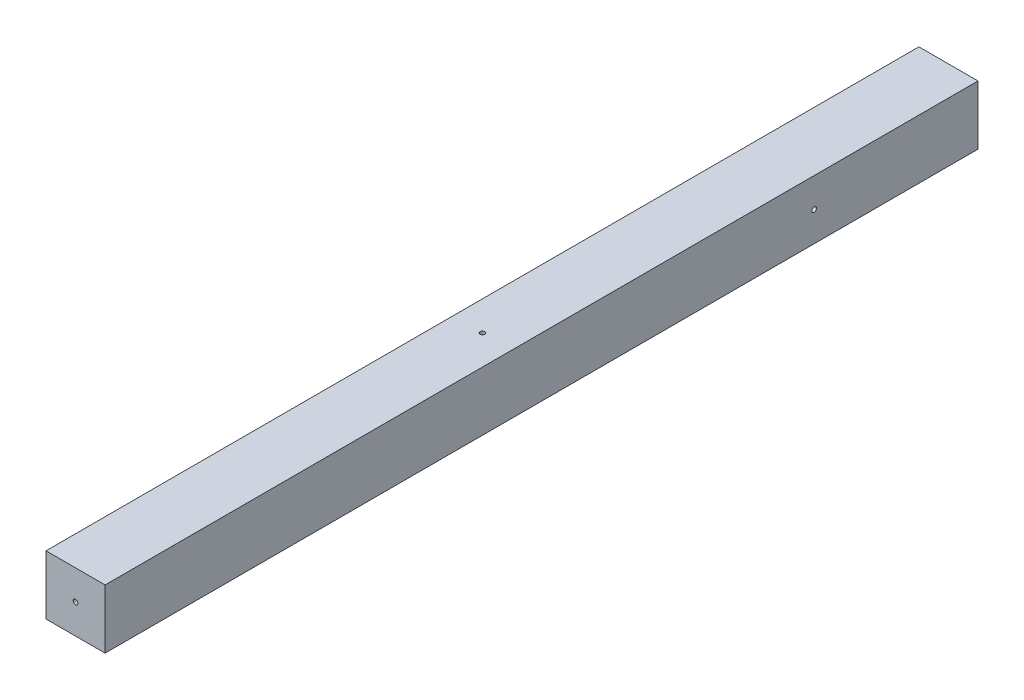
ISO-10303-21;
HEADER;
FILE_DESCRIPTION(('STEP AP214'),'2;1');
FILE_NAME('part.step','',(''),(''),'','','');
FILE_SCHEMA(('AUTOMOTIVE_DESIGN { 1 0 10303 214 1 1 1 1 }'));
ENDSEC;
DATA;
#1=APPLICATION_CONTEXT('core data for automotive mechanical design processes');
#2=APPLICATION_PROTOCOL_DEFINITION('international standard','automotive_design',2000,#1);
#3=PRODUCT_CONTEXT('',#1,'mechanical');
#4=PRODUCT('Part','Part','',(#3));
#5=PRODUCT_RELATED_PRODUCT_CATEGORY('part','',(#4));
#6=PRODUCT_DEFINITION_FORMATION('','',#4);
#7=PRODUCT_DEFINITION_CONTEXT('part definition',#1,'design');
#8=PRODUCT_DEFINITION('design','',#6,#7);
#9=PRODUCT_DEFINITION_SHAPE('','',#8);
#10=(LENGTH_UNIT() NAMED_UNIT(*) SI_UNIT(.MILLI.,.METRE.));
#11=(NAMED_UNIT(*) PLANE_ANGLE_UNIT() SI_UNIT($,.RADIAN.));
#12=(NAMED_UNIT(*) SI_UNIT($,.STERADIAN.) SOLID_ANGLE_UNIT());
#13=UNCERTAINTY_MEASURE_WITH_UNIT(LENGTH_MEASURE(1.E-05),#10,'distance_accuracy_value','');
#14=(GEOMETRIC_REPRESENTATION_CONTEXT(3) GLOBAL_UNCERTAINTY_ASSIGNED_CONTEXT((#13)) GLOBAL_UNIT_ASSIGNED_CONTEXT((#10,
#11,#12)) REPRESENTATION_CONTEXT('',''));
#15=CARTESIAN_POINT('',(0.,0.,0.));
#16=DIRECTION('',(0.,0.,1.));
#17=DIRECTION('',(1.,0.,0.));
#18=AXIS2_PLACEMENT_3D('',#15,#16,#17);
#19=CARTESIAN_POINT('',(-22.,22.,650.));
#20=DIRECTION('',(1.,0.,0.));
#21=DIRECTION('',(0.,1.,0.));
#22=AXIS2_PLACEMENT_3D('',#19,#20,#21);
#23=PLANE('',#22);
#24=CARTESIAN_POINT('',(-22.,0.,122.));
#25=DIRECTION('',(1.,0.,0.));
#26=DIRECTION('',(0.,1.,0.));
#27=AXIS2_PLACEMENT_3D('',#24,#25,#26);
#28=CIRCLE('',#27,1.75);
#29=CARTESIAN_POINT('',(-22.,1.75,122.));
#30=VERTEX_POINT('',#29);
#31=EDGE_CURVE('E132',#30,#30,#28,.T.);
#32=ORIENTED_EDGE('',*,*,#31,.T.);
#33=EDGE_LOOP('',(#32));
#34=FACE_BOUND('',#33,.T.);
#35=DIRECTION('',(0.,-1.,0.));
#36=VECTOR('',#35,1.);
#37=CARTESIAN_POINT('',(-22.,22.,0.));
#38=LINE('',#37,#36);
#39=CARTESIAN_POINT('',(-22.,22.,0.));
#40=VERTEX_POINT('',#39);
#41=CARTESIAN_POINT('',(-22.,-22.,0.));
#42=VERTEX_POINT('',#41);
#43=EDGE_CURVE('E110',#40,#42,#38,.T.);
#44=ORIENTED_EDGE('',*,*,#43,.T.);
#45=DIRECTION('',(0.,0.,-1.));
#46=VECTOR('',#45,1.);
#47=CARTESIAN_POINT('',(-22.,-22.,650.));
#48=LINE('',#47,#46);
#49=CARTESIAN_POINT('',(-22.,-22.,650.));
#50=VERTEX_POINT('',#49);
#51=EDGE_CURVE('E11',#50,#42,#48,.T.);
#52=ORIENTED_EDGE('',*,*,#51,.F.);
#53=DIRECTION('',(0.,-1.,0.));
#54=VECTOR('',#53,1.);
#55=CARTESIAN_POINT('',(-22.,22.,650.));
#56=LINE('',#55,#54);
#57=CARTESIAN_POINT('',(-22.,22.,650.));
#58=VERTEX_POINT('',#57);
#59=EDGE_CURVE('E97',#58,#50,#56,.T.);
#60=ORIENTED_EDGE('',*,*,#59,.F.);
#61=DIRECTION('',(0.,0.,-1.));
#62=VECTOR('',#61,1.);
#63=CARTESIAN_POINT('',(-22.,22.,650.));
#64=LINE('',#63,#62);
#65=EDGE_CURVE('E106',#58,#40,#64,.T.);
#66=ORIENTED_EDGE('',*,*,#65,.T.);
#67=EDGE_LOOP('',(#44,#52,#60,#66));
#68=FACE_BOUND('',#67,.T.);
#69=ADVANCED_FACE('F45',(#34,#68),#23,.F.);
#70=CARTESIAN_POINT('',(22.,-22.,650.));
#71=DIRECTION('',(0.,1.,0.));
#72=DIRECTION('',(-1.,0.,0.));
#73=AXIS2_PLACEMENT_3D('',#70,#71,#72);
#74=PLANE('',#73);
#75=CARTESIAN_POINT('',(0.,-22.,347.));
#76=DIRECTION('',(0.,-1.,0.));
#77=DIRECTION('',(1.,0.,0.));
#78=AXIS2_PLACEMENT_3D('',#75,#76,#77);
#79=CIRCLE('',#78,1.75);
#80=CARTESIAN_POINT('',(1.75,-22.,347.));
#81=VERTEX_POINT('',#80);
#82=EDGE_CURVE('E135',#81,#81,#79,.T.);
#83=ORIENTED_EDGE('',*,*,#82,.F.);
#84=EDGE_LOOP('',(#83));
#85=FACE_BOUND('',#84,.T.);
#86=DIRECTION('',(1.,0.,0.));
#87=VECTOR('',#86,1.);
#88=CARTESIAN_POINT('',(22.,-22.,0.));
#89=LINE('',#88,#87);
#90=CARTESIAN_POINT('',(22.,-22.,0.));
#91=VERTEX_POINT('',#90);
#92=EDGE_CURVE('E101',#42,#91,#89,.T.);
#93=ORIENTED_EDGE('',*,*,#92,.T.);
#94=DIRECTION('',(0.,0.,-1.));
#95=VECTOR('',#94,1.);
#96=CARTESIAN_POINT('',(22.,-22.,650.));
#97=LINE('',#96,#95);
#98=CARTESIAN_POINT('',(22.,-22.,650.));
#99=VERTEX_POINT('',#98);
#100=EDGE_CURVE('E54',#99,#91,#97,.T.);
#101=ORIENTED_EDGE('',*,*,#100,.F.);
#102=DIRECTION('',(1.,0.,0.));
#103=VECTOR('',#102,1.);
#104=CARTESIAN_POINT('',(22.,-22.,650.));
#105=LINE('',#104,#103);
#106=EDGE_CURVE('E92',#50,#99,#105,.T.);
#107=ORIENTED_EDGE('',*,*,#106,.F.);
#108=ORIENTED_EDGE('',*,*,#51,.T.);
#109=EDGE_LOOP('',(#93,#101,#107,#108));
#110=FACE_BOUND('',#109,.T.);
#111=ADVANCED_FACE('F100',(#85,#110),#74,.F.);
#112=CARTESIAN_POINT('',(22.,22.,650.));
#113=DIRECTION('',(-1.,0.,0.));
#114=DIRECTION('',(0.,-1.,0.));
#115=AXIS2_PLACEMENT_3D('',#112,#113,#114);
#116=PLANE('',#115);
#117=CARTESIAN_POINT('',(22.,0.,122.));
#118=DIRECTION('',(-1.,0.,0.));
#119=DIRECTION('',(0.,-1.,0.));
#120=AXIS2_PLACEMENT_3D('',#117,#118,#119);
#121=CIRCLE('',#120,1.75);
#122=CARTESIAN_POINT('',(22.,-1.75,122.));
#123=VERTEX_POINT('',#122);
#124=EDGE_CURVE('E127',#123,#123,#121,.T.);
#125=ORIENTED_EDGE('',*,*,#124,.T.);
#126=EDGE_LOOP('',(#125));
#127=FACE_BOUND('',#126,.T.);
#128=DIRECTION('',(0.,1.,0.));
#129=VECTOR('',#128,1.);
#130=CARTESIAN_POINT('',(22.,22.,0.));
#131=LINE('',#130,#129);
#132=CARTESIAN_POINT('',(22.,22.,0.));
#133=VERTEX_POINT('',#132);
#134=EDGE_CURVE('E79',#91,#133,#131,.T.);
#135=ORIENTED_EDGE('',*,*,#134,.T.);
#136=DIRECTION('',(0.,0.,-1.));
#137=VECTOR('',#136,1.);
#138=CARTESIAN_POINT('',(22.,22.,650.));
#139=LINE('',#138,#137);
#140=CARTESIAN_POINT('',(22.,22.,650.));
#141=VERTEX_POINT('',#140);
#142=EDGE_CURVE('E102',#141,#133,#139,.T.);
#143=ORIENTED_EDGE('',*,*,#142,.F.);
#144=DIRECTION('',(0.,1.,0.));
#145=VECTOR('',#144,1.);
#146=CARTESIAN_POINT('',(22.,22.,650.));
#147=LINE('',#146,#145);
#148=EDGE_CURVE('E95',#99,#141,#147,.T.);
#149=ORIENTED_EDGE('',*,*,#148,.F.);
#150=ORIENTED_EDGE('',*,*,#100,.T.);
#151=EDGE_LOOP('',(#135,#143,#149,#150));
#152=FACE_BOUND('',#151,.T.);
#153=ADVANCED_FACE('F104',(#127,#152),#116,.F.);
#154=CARTESIAN_POINT('',(22.,22.,650.));
#155=DIRECTION('',(0.,-1.,0.));
#156=DIRECTION('',(1.,0.,0.));
#157=AXIS2_PLACEMENT_3D('',#154,#155,#156);
#158=PLANE('',#157);
#159=CARTESIAN_POINT('',(0.,22.,347.));
#160=DIRECTION('',(0.,-1.,0.));
#161=DIRECTION('',(1.,0.,0.));
#162=AXIS2_PLACEMENT_3D('',#159,#160,#161);
#163=CIRCLE('',#162,1.75);
#164=CARTESIAN_POINT('',(1.75,22.,347.));
#165=VERTEX_POINT('',#164);
#166=EDGE_CURVE('E48',#165,#165,#163,.T.);
#167=ORIENTED_EDGE('',*,*,#166,.T.);
#168=EDGE_LOOP('',(#167));
#169=FACE_BOUND('',#168,.T.);
#170=DIRECTION('',(-1.,0.,0.));
#171=VECTOR('',#170,1.);
#172=CARTESIAN_POINT('',(22.,22.,0.));
#173=LINE('',#172,#171);
#174=EDGE_CURVE('E85',#133,#40,#173,.T.);
#175=ORIENTED_EDGE('',*,*,#174,.T.);
#176=ORIENTED_EDGE('',*,*,#65,.F.);
#177=DIRECTION('',(-1.,0.,0.));
#178=VECTOR('',#177,1.);
#179=CARTESIAN_POINT('',(22.,22.,650.));
#180=LINE('',#179,#178);
#181=EDGE_CURVE('E62',#141,#58,#180,.T.);
#182=ORIENTED_EDGE('',*,*,#181,.F.);
#183=ORIENTED_EDGE('',*,*,#142,.T.);
#184=EDGE_LOOP('',(#175,#176,#182,#183));
#185=FACE_BOUND('',#184,.T.);
#186=ADVANCED_FACE('F118',(#169,#185),#158,.F.);
#187=CARTESIAN_POINT('',(0.,0.,650.));
#188=DIRECTION('',(0.,0.,-1.));
#189=DIRECTION('',(-1.,0.,0.));
#190=AXIS2_PLACEMENT_3D('',#187,#188,#189);
#191=PLANE('',#190);
#192=CARTESIAN_POINT('',(0.,0.,650.));
#193=DIRECTION('',(0.,0.,-1.));
#194=DIRECTION('',(-1.,0.,0.));
#195=AXIS2_PLACEMENT_3D('',#192,#193,#194);
#196=CIRCLE('',#195,1.75);
#197=CARTESIAN_POINT('',(-1.75,0.,650.));
#198=VERTEX_POINT('',#197);
#199=EDGE_CURVE('E124',#198,#198,#196,.T.);
#200=ORIENTED_EDGE('',*,*,#199,.T.);
#201=EDGE_LOOP('',(#200));
#202=FACE_BOUND('',#201,.T.);
#203=ORIENTED_EDGE('',*,*,#59,.T.);
#204=ORIENTED_EDGE('',*,*,#106,.T.);
#205=ORIENTED_EDGE('',*,*,#148,.T.);
#206=ORIENTED_EDGE('',*,*,#181,.T.);
#207=EDGE_LOOP('',(#203,#204,#205,#206));
#208=FACE_BOUND('',#207,.T.);
#209=ADVANCED_FACE('F93',(#202,#208),#191,.F.);
#210=CARTESIAN_POINT('',(0.,0.,0.));
#211=DIRECTION('',(0.,0.,-1.));
#212=DIRECTION('',(-1.,0.,0.));
#213=AXIS2_PLACEMENT_3D('',#210,#211,#212);
#214=PLANE('',#213);
#215=ORIENTED_EDGE('',*,*,#43,.F.);
#216=ORIENTED_EDGE('',*,*,#174,.F.);
#217=ORIENTED_EDGE('',*,*,#134,.F.);
#218=ORIENTED_EDGE('',*,*,#92,.F.);
#219=EDGE_LOOP('',(#215,#216,#217,#218));
#220=FACE_BOUND('',#219,.T.);
#221=ADVANCED_FACE('F121',(#220),#214,.T.);
#222=CARTESIAN_POINT('',(0.,0.,590.));
#223=DIRECTION('',(0.,0.,1.));
#224=DIRECTION('',(1.,0.,0.));
#225=AXIS2_PLACEMENT_3D('',#222,#223,#224);
#226=CYLINDRICAL_SURFACE('',#225,1.75);
#227=CARTESIAN_POINT('',(0.,0.,590.));
#228=DIRECTION('',(0.,0.,-1.));
#229=DIRECTION('',(-1.,0.,0.));
#230=AXIS2_PLACEMENT_3D('',#227,#228,#229);
#231=CIRCLE('',#230,1.75);
#232=CARTESIAN_POINT('',(-1.75,0.,590.));
#233=VERTEX_POINT('',#232);
#234=EDGE_CURVE('E113',#233,#233,#231,.T.);
#235=ORIENTED_EDGE('',*,*,#234,.T.);
#236=EDGE_LOOP('',(#235));
#237=FACE_BOUND('',#236,.T.);
#238=ORIENTED_EDGE('',*,*,#199,.F.);
#239=EDGE_LOOP('',(#238));
#240=FACE_BOUND('',#239,.T.);
#241=ADVANCED_FACE('F172',(#237,#240),#226,.F.);
#242=CARTESIAN_POINT('',(0.,0.,590.));
#243=DIRECTION('',(0.,0.,-1.));
#244=DIRECTION('',(-1.,0.,0.));
#245=AXIS2_PLACEMENT_3D('',#242,#243,#244);
#246=PLANE('',#245);
#247=ORIENTED_EDGE('',*,*,#234,.F.);
#248=EDGE_LOOP('',(#247));
#249=FACE_BOUND('',#248,.T.);
#250=ADVANCED_FACE('F151',(#249),#246,.F.);
#251=CARTESIAN_POINT('',(26.9497474683058,0.,122.));
#252=DIRECTION('',(-1.,0.,0.));
#253=DIRECTION('',(0.,-1.,0.));
#254=AXIS2_PLACEMENT_3D('',#251,#252,#253);
#255=CYLINDRICAL_SURFACE('',#254,1.75);
#256=ORIENTED_EDGE('',*,*,#124,.F.);
#257=EDGE_LOOP('',(#256));
#258=FACE_BOUND('',#257,.T.);
#259=ORIENTED_EDGE('',*,*,#31,.F.);
#260=EDGE_LOOP('',(#259));
#261=FACE_BOUND('',#260,.T.);
#262=ADVANCED_FACE('F145',(#258,#261),#255,.F.);
#263=CARTESIAN_POINT('',(0.,38.,347.));
#264=DIRECTION('',(0.,-1.,0.));
#265=DIRECTION('',(1.,0.,0.));
#266=AXIS2_PLACEMENT_3D('',#263,#264,#265);
#267=CYLINDRICAL_SURFACE('',#266,1.75);
#268=ORIENTED_EDGE('',*,*,#82,.T.);
#269=EDGE_LOOP('',(#268));
#270=FACE_BOUND('',#269,.T.);
#271=ORIENTED_EDGE('',*,*,#166,.F.);
#272=EDGE_LOOP('',(#271));
#273=FACE_BOUND('',#272,.T.);
#274=ADVANCED_FACE('F143',(#270,#273),#267,.F.);
#275=CLOSED_SHELL('',(#69,#111,#153,#186,#209,#221,#241,#250,#262,#274));
#276=MANIFOLD_SOLID_BREP('B2',#275);
#277=ADVANCED_BREP_SHAPE_REPRESENTATION('',(#18,#276),#14);
#278=SHAPE_DEFINITION_REPRESENTATION(#9,#277);
ENDSEC;
END-ISO-10303-21;
